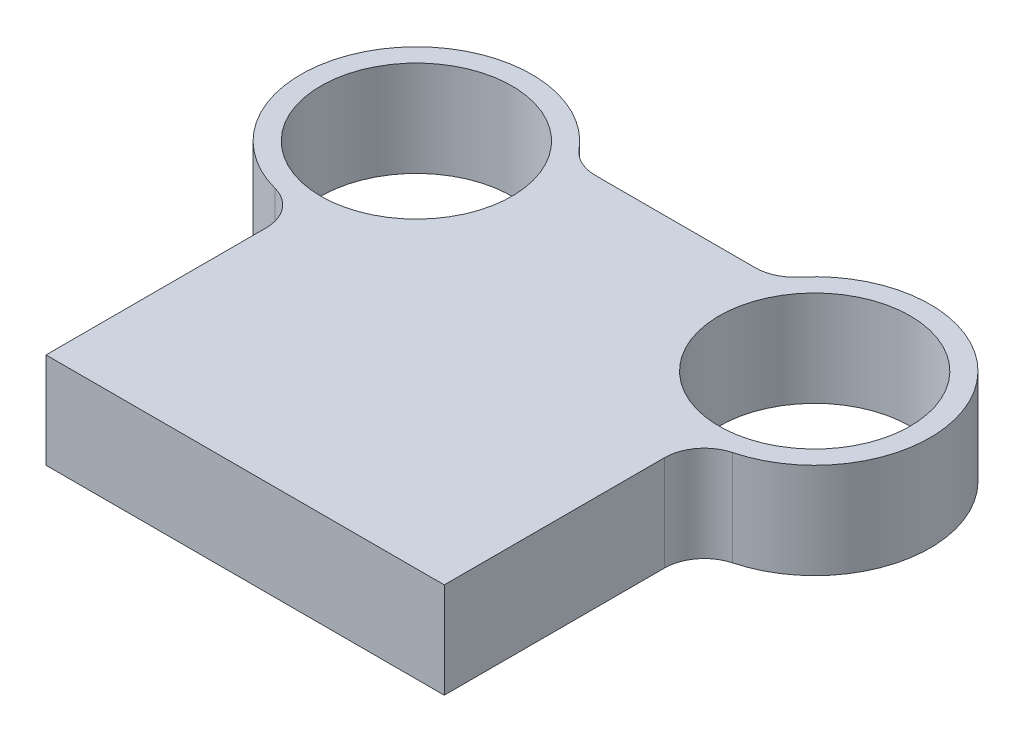
ISO-10303-21;
HEADER;
FILE_DESCRIPTION(('STEP AP214'),'2;1');
FILE_NAME('part.step','',(''),(''),'','','');
FILE_SCHEMA(('AUTOMOTIVE_DESIGN { 1 0 10303 214 1 1 1 1 }'));
ENDSEC;
DATA;
#1=APPLICATION_CONTEXT('core data for automotive mechanical design processes');
#2=APPLICATION_PROTOCOL_DEFINITION('international standard','automotive_design',2000,#1);
#3=PRODUCT_CONTEXT('',#1,'mechanical');
#4=PRODUCT('Part','Part','',(#3));
#5=PRODUCT_RELATED_PRODUCT_CATEGORY('part','',(#4));
#6=PRODUCT_DEFINITION_FORMATION('','',#4);
#7=PRODUCT_DEFINITION_CONTEXT('part definition',#1,'design');
#8=PRODUCT_DEFINITION('design','',#6,#7);
#9=PRODUCT_DEFINITION_SHAPE('','',#8);
#10=(LENGTH_UNIT() NAMED_UNIT(*) SI_UNIT(.MILLI.,.METRE.));
#11=(NAMED_UNIT(*) PLANE_ANGLE_UNIT() SI_UNIT($,.RADIAN.));
#12=(NAMED_UNIT(*) SI_UNIT($,.STERADIAN.) SOLID_ANGLE_UNIT());
#13=UNCERTAINTY_MEASURE_WITH_UNIT(LENGTH_MEASURE(1.E-05),#10,'distance_accuracy_value','');
#14=(GEOMETRIC_REPRESENTATION_CONTEXT(3) GLOBAL_UNCERTAINTY_ASSIGNED_CONTEXT((#13)) GLOBAL_UNIT_ASSIGNED_CONTEXT((#10,
#11,#12)) REPRESENTATION_CONTEXT('',''));
#15=CARTESIAN_POINT('',(0.,0.,0.));
#16=DIRECTION('',(0.,0.,1.));
#17=DIRECTION('',(1.,0.,0.));
#18=AXIS2_PLACEMENT_3D('',#15,#16,#17);
#19=CARTESIAN_POINT('',(-50.,24.,-93.));
#20=DIRECTION('',(0.,1.,0.));
#21=DIRECTION('',(0.,0.,1.));
#22=AXIS2_PLACEMENT_3D('',#19,#20,#21);
#23=PLANE('',#22);
#24=CARTESIAN_POINT('',(-50.,24.,-93.));
#25=DIRECTION('',(0.,1.,0.));
#26=DIRECTION('',(0.,0.,1.));
#27=AXIS2_PLACEMENT_3D('',#24,#25,#26);
#28=CIRCLE('',#27,24.);
#29=CARTESIAN_POINT('',(-50.,24.,-69.));
#30=VERTEX_POINT('',#29);
#31=EDGE_CURVE('E240',#30,#30,#28,.T.);
#32=ORIENTED_EDGE('',*,*,#31,.F.);
#33=EDGE_LOOP('',(#32));
#34=FACE_BOUND('',#33,.T.);
#35=CARTESIAN_POINT('',(-50.,24.,-93.));
#36=DIRECTION('',(0.,1.,0.));
#37=DIRECTION('',(0.,0.,1.));
#38=AXIS2_PLACEMENT_3D('',#35,#36,#37);
#39=CIRCLE('',#38,29.);
#40=CARTESIAN_POINT('',(-27.7419355453448,24.,-111.589743589744));
#41=VERTEX_POINT('',#40);
#42=CARTESIAN_POINT('',(-57.4358974358974,24.,-64.9695267731204));
#43=VERTEX_POINT('',#42);
#44=EDGE_CURVE('E133',#41,#43,#39,.T.);
#45=ORIENTED_EDGE('',*,*,#44,.T.);
#46=CARTESIAN_POINT('',(-60.,24.,-55.3038463500585));
#47=DIRECTION('',(0.,1.,0.));
#48=DIRECTION('',(0.,0.,1.));
#49=AXIS2_PLACEMENT_3D('',#46,#47,#48);
#50=CIRCLE('',#49,10.);
#51=CARTESIAN_POINT('',(-50.,24.,-55.3038463500585));
#52=VERTEX_POINT('',#51);
#53=EDGE_CURVE('E11',#43,#52,#50,.F.);
#54=ORIENTED_EDGE('',*,*,#53,.T.);
#55=DIRECTION('',(0.,0.,1.));
#56=VECTOR('',#55,1.);
#57=CARTESIAN_POINT('',(-50.,24.,0.));
#58=LINE('',#57,#56);
#59=CARTESIAN_POINT('',(-50.,24.,0.));
#60=VERTEX_POINT('',#59);
#61=EDGE_CURVE('E106',#52,#60,#58,.T.);
#62=ORIENTED_EDGE('',*,*,#61,.T.);
#63=DIRECTION('',(1.,0.,0.));
#64=VECTOR('',#63,1.);
#65=CARTESIAN_POINT('',(50.,24.,0.));
#66=LINE('',#65,#64);
#67=CARTESIAN_POINT('',(50.,24.,0.));
#68=VERTEX_POINT('',#67);
#69=EDGE_CURVE('E110',#60,#68,#66,.T.);
#70=ORIENTED_EDGE('',*,*,#69,.T.);
#71=DIRECTION('',(0.,0.,-1.));
#72=VECTOR('',#71,1.);
#73=CARTESIAN_POINT('',(50.,24.,0.));
#74=LINE('',#73,#72);
#75=CARTESIAN_POINT('',(50.,24.,-55.3038463500585));
#76=VERTEX_POINT('',#75);
#77=EDGE_CURVE('E123',#68,#76,#74,.T.);
#78=ORIENTED_EDGE('',*,*,#77,.T.);
#79=CARTESIAN_POINT('',(60.,24.,-55.3038463500585));
#80=DIRECTION('',(0.,1.,0.));
#81=DIRECTION('',(0.,0.,1.));
#82=AXIS2_PLACEMENT_3D('',#79,#80,#81);
#83=CIRCLE('',#82,10.);
#84=CARTESIAN_POINT('',(57.4358974358974,24.,-64.9695267731204));
#85=VERTEX_POINT('',#84);
#86=EDGE_CURVE('E155',#76,#85,#83,.F.);
#87=ORIENTED_EDGE('',*,*,#86,.T.);
#88=CARTESIAN_POINT('',(50.,24.,-93.));
#89=DIRECTION('',(0.,1.,0.));
#90=DIRECTION('',(0.,0.,-1.));
#91=AXIS2_PLACEMENT_3D('',#88,#89,#90);
#92=CIRCLE('',#91,29.);
#93=CARTESIAN_POINT('',(27.7419355453448,24.,-111.589743589744));
#94=VERTEX_POINT('',#93);
#95=EDGE_CURVE('E229',#85,#94,#92,.T.);
#96=ORIENTED_EDGE('',*,*,#95,.T.);
#97=CARTESIAN_POINT('',(20.0667409058085,24.,-118.));
#98=DIRECTION('',(0.,1.,0.));
#99=DIRECTION('',(0.,0.,1.));
#100=AXIS2_PLACEMENT_3D('',#97,#98,#99);
#101=CIRCLE('',#100,10.);
#102=CARTESIAN_POINT('',(20.0667409058085,24.,-108.));
#103=VERTEX_POINT('',#102);
#104=EDGE_CURVE('E159',#94,#103,#101,.F.);
#105=ORIENTED_EDGE('',*,*,#104,.T.);
#106=DIRECTION('',(-1.,0.,0.));
#107=VECTOR('',#106,1.);
#108=CARTESIAN_POINT('',(25.1806527080183,24.,-108.));
#109=LINE('',#108,#107);
#110=CARTESIAN_POINT('',(-20.0667409058085,24.,-108.));
#111=VERTEX_POINT('',#110);
#112=EDGE_CURVE('E226',#103,#111,#109,.T.);
#113=ORIENTED_EDGE('',*,*,#112,.T.);
#114=CARTESIAN_POINT('',(-20.0667409058085,24.,-118.));
#115=DIRECTION('',(0.,1.,0.));
#116=DIRECTION('',(0.,0.,1.));
#117=AXIS2_PLACEMENT_3D('',#114,#115,#116);
#118=CIRCLE('',#117,10.);
#119=EDGE_CURVE('E163',#111,#41,#118,.F.);
#120=ORIENTED_EDGE('',*,*,#119,.T.);
#121=EDGE_LOOP('',(#45,#54,#62,#70,#78,#87,#96,#105,#113,#120));
#122=FACE_BOUND('',#121,.T.);
#123=CARTESIAN_POINT('',(50.,24.,-93.));
#124=DIRECTION('',(0.,1.,0.));
#125=DIRECTION('',(0.,0.,-1.));
#126=AXIS2_PLACEMENT_3D('',#123,#124,#125);
#127=CIRCLE('',#126,24.);
#128=CARTESIAN_POINT('',(50.,24.,-117.));
#129=VERTEX_POINT('',#128);
#130=EDGE_CURVE('E257',#129,#129,#127,.T.);
#131=ORIENTED_EDGE('',*,*,#130,.F.);
#132=EDGE_LOOP('',(#131));
#133=FACE_BOUND('',#132,.T.);
#134=ADVANCED_FACE('F33',(#34,#122,#133),#23,.T.);
#135=CARTESIAN_POINT('',(-50.,0.,-93.));
#136=DIRECTION('',(0.,1.,0.));
#137=DIRECTION('',(0.,0.,1.));
#138=AXIS2_PLACEMENT_3D('',#135,#136,#137);
#139=PLANE('',#138);
#140=DIRECTION('',(0.,0.,1.));
#141=VECTOR('',#140,1.);
#142=CARTESIAN_POINT('',(-50.,0.,0.));
#143=LINE('',#142,#141);
#144=CARTESIAN_POINT('',(-50.,0.,-55.3038463500585));
#145=VERTEX_POINT('',#144);
#146=CARTESIAN_POINT('',(-50.,0.,0.));
#147=VERTEX_POINT('',#146);
#148=EDGE_CURVE('E127',#145,#147,#143,.T.);
#149=ORIENTED_EDGE('',*,*,#148,.F.);
#150=CARTESIAN_POINT('',(-60.,0.,-55.3038463500585));
#151=DIRECTION('',(0.,1.,0.));
#152=DIRECTION('',(0.,0.,1.));
#153=AXIS2_PLACEMENT_3D('',#150,#151,#152);
#154=CIRCLE('',#153,10.);
#155=CARTESIAN_POINT('',(-57.4358974358974,0.,-64.9695267731204));
#156=VERTEX_POINT('',#155);
#157=EDGE_CURVE('E41',#145,#156,#154,.T.);
#158=ORIENTED_EDGE('',*,*,#157,.T.);
#159=CARTESIAN_POINT('',(-50.,0.,-93.));
#160=DIRECTION('',(0.,1.,0.));
#161=DIRECTION('',(0.,0.,1.));
#162=AXIS2_PLACEMENT_3D('',#159,#160,#161);
#163=CIRCLE('',#162,29.);
#164=CARTESIAN_POINT('',(-27.7419355453448,0.,-111.589743589744));
#165=VERTEX_POINT('',#164);
#166=EDGE_CURVE('E114',#165,#156,#163,.T.);
#167=ORIENTED_EDGE('',*,*,#166,.F.);
#168=CARTESIAN_POINT('',(-20.0667409058085,0.,-118.));
#169=DIRECTION('',(0.,1.,0.));
#170=DIRECTION('',(0.,0.,1.));
#171=AXIS2_PLACEMENT_3D('',#168,#169,#170);
#172=CIRCLE('',#171,10.);
#173=CARTESIAN_POINT('',(-20.0667409058085,0.,-108.));
#174=VERTEX_POINT('',#173);
#175=EDGE_CURVE('E161',#165,#174,#172,.T.);
#176=ORIENTED_EDGE('',*,*,#175,.T.);
#177=DIRECTION('',(-1.,0.,0.));
#178=VECTOR('',#177,1.);
#179=CARTESIAN_POINT('',(25.1806527080183,0.,-108.));
#180=LINE('',#179,#178);
#181=CARTESIAN_POINT('',(20.0667409058085,0.,-108.));
#182=VERTEX_POINT('',#181);
#183=EDGE_CURVE('E173',#182,#174,#180,.T.);
#184=ORIENTED_EDGE('',*,*,#183,.F.);
#185=CARTESIAN_POINT('',(20.0667409058085,0.,-118.));
#186=DIRECTION('',(0.,1.,0.));
#187=DIRECTION('',(0.,0.,1.));
#188=AXIS2_PLACEMENT_3D('',#185,#186,#187);
#189=CIRCLE('',#188,10.);
#190=CARTESIAN_POINT('',(27.7419355453448,0.,-111.589743589744));
#191=VERTEX_POINT('',#190);
#192=EDGE_CURVE('E157',#182,#191,#189,.T.);
#193=ORIENTED_EDGE('',*,*,#192,.T.);
#194=CARTESIAN_POINT('',(50.,0.,-93.));
#195=DIRECTION('',(0.,1.,0.));
#196=DIRECTION('',(0.,0.,-1.));
#197=AXIS2_PLACEMENT_3D('',#194,#195,#196);
#198=CIRCLE('',#197,29.);
#199=CARTESIAN_POINT('',(57.4358974358974,0.,-64.9695267731204));
#200=VERTEX_POINT('',#199);
#201=EDGE_CURVE('E245',#200,#191,#198,.T.);
#202=ORIENTED_EDGE('',*,*,#201,.F.);
#203=CARTESIAN_POINT('',(60.,0.,-55.3038463500585));
#204=DIRECTION('',(0.,1.,0.));
#205=DIRECTION('',(0.,0.,1.));
#206=AXIS2_PLACEMENT_3D('',#203,#204,#205);
#207=CIRCLE('',#206,10.);
#208=CARTESIAN_POINT('',(50.,0.,-55.3038463500585));
#209=VERTEX_POINT('',#208);
#210=EDGE_CURVE('E153',#200,#209,#207,.T.);
#211=ORIENTED_EDGE('',*,*,#210,.T.);
#212=DIRECTION('',(0.,0.,-1.));
#213=VECTOR('',#212,1.);
#214=CARTESIAN_POINT('',(50.,0.,0.));
#215=LINE('',#214,#213);
#216=CARTESIAN_POINT('',(50.,0.,0.));
#217=VERTEX_POINT('',#216);
#218=EDGE_CURVE('E242',#217,#209,#215,.T.);
#219=ORIENTED_EDGE('',*,*,#218,.F.);
#220=DIRECTION('',(1.,0.,0.));
#221=VECTOR('',#220,1.);
#222=CARTESIAN_POINT('',(50.,0.,0.));
#223=LINE('',#222,#221);
#224=EDGE_CURVE('E239',#147,#217,#223,.T.);
#225=ORIENTED_EDGE('',*,*,#224,.F.);
#226=EDGE_LOOP('',(#149,#158,#167,#176,#184,#193,#202,#211,#219,#225));
#227=FACE_BOUND('',#226,.T.);
#228=CARTESIAN_POINT('',(-50.,0.,-93.));
#229=DIRECTION('',(0.,1.,0.));
#230=DIRECTION('',(0.,0.,1.));
#231=AXIS2_PLACEMENT_3D('',#228,#229,#230);
#232=CIRCLE('',#231,24.);
#233=CARTESIAN_POINT('',(-50.,0.,-69.));
#234=VERTEX_POINT('',#233);
#235=EDGE_CURVE('E254',#234,#234,#232,.T.);
#236=ORIENTED_EDGE('',*,*,#235,.T.);
#237=EDGE_LOOP('',(#236));
#238=FACE_BOUND('',#237,.T.);
#239=CARTESIAN_POINT('',(50.,0.,-93.));
#240=DIRECTION('',(0.,1.,0.));
#241=DIRECTION('',(0.,0.,-1.));
#242=AXIS2_PLACEMENT_3D('',#239,#240,#241);
#243=CIRCLE('',#242,24.);
#244=CARTESIAN_POINT('',(50.,0.,-117.));
#245=VERTEX_POINT('',#244);
#246=EDGE_CURVE('E260',#245,#245,#243,.T.);
#247=ORIENTED_EDGE('',*,*,#246,.T.);
#248=EDGE_LOOP('',(#247));
#249=FACE_BOUND('',#248,.T.);
#250=ADVANCED_FACE('F167',(#227,#238,#249),#139,.F.);
#251=CARTESIAN_POINT('',(-50.,24.,0.));
#252=DIRECTION('',(1.,0.,0.));
#253=DIRECTION('',(0.,0.,-1.));
#254=AXIS2_PLACEMENT_3D('',#251,#252,#253);
#255=PLANE('',#254);
#256=ORIENTED_EDGE('',*,*,#61,.F.);
#257=DIRECTION('',(0.,1.,0.));
#258=VECTOR('',#257,1.);
#259=CARTESIAN_POINT('',(-50.,0.,-55.3038463500585));
#260=LINE('',#259,#258);
#261=EDGE_CURVE('E151',#52,#145,#260,.F.);
#262=ORIENTED_EDGE('',*,*,#261,.T.);
#263=ORIENTED_EDGE('',*,*,#148,.T.);
#264=DIRECTION('',(0.,-1.,0.));
#265=VECTOR('',#264,1.);
#266=CARTESIAN_POINT('',(-50.,24.,0.));
#267=LINE('',#266,#265);
#268=EDGE_CURVE('E119',#60,#147,#267,.T.);
#269=ORIENTED_EDGE('',*,*,#268,.F.);
#270=EDGE_LOOP('',(#256,#262,#263,#269));
#271=FACE_BOUND('',#270,.T.);
#272=ADVANCED_FACE('F125',(#271),#255,.F.);
#273=CARTESIAN_POINT('',(50.,24.,0.));
#274=DIRECTION('',(0.,0.,-1.));
#275=DIRECTION('',(-1.,0.,0.));
#276=AXIS2_PLACEMENT_3D('',#273,#274,#275);
#277=PLANE('',#276);
#278=ORIENTED_EDGE('',*,*,#224,.T.);
#279=DIRECTION('',(0.,-1.,0.));
#280=VECTOR('',#279,1.);
#281=CARTESIAN_POINT('',(50.,24.,0.));
#282=LINE('',#281,#280);
#283=EDGE_CURVE('E121',#68,#217,#282,.T.);
#284=ORIENTED_EDGE('',*,*,#283,.F.);
#285=ORIENTED_EDGE('',*,*,#69,.F.);
#286=ORIENTED_EDGE('',*,*,#268,.T.);
#287=EDGE_LOOP('',(#278,#284,#285,#286));
#288=FACE_BOUND('',#287,.T.);
#289=ADVANCED_FACE('F118',(#288),#277,.F.);
#290=CARTESIAN_POINT('',(50.,24.,0.));
#291=DIRECTION('',(-1.,0.,0.));
#292=DIRECTION('',(0.,0.,1.));
#293=AXIS2_PLACEMENT_3D('',#290,#291,#292);
#294=PLANE('',#293);
#295=ORIENTED_EDGE('',*,*,#218,.T.);
#296=DIRECTION('',(0.,1.,0.));
#297=VECTOR('',#296,1.);
#298=CARTESIAN_POINT('',(50.,24.,-55.3038463500585));
#299=LINE('',#298,#297);
#300=EDGE_CURVE('E139',#209,#76,#299,.T.);
#301=ORIENTED_EDGE('',*,*,#300,.T.);
#302=ORIENTED_EDGE('',*,*,#77,.F.);
#303=ORIENTED_EDGE('',*,*,#283,.T.);
#304=EDGE_LOOP('',(#295,#301,#302,#303));
#305=FACE_BOUND('',#304,.T.);
#306=ADVANCED_FACE('F202',(#305),#294,.F.);
#307=CARTESIAN_POINT('',(50.,24.,-93.));
#308=DIRECTION('',(0.,-1.,0.));
#309=DIRECTION('',(0.,0.,-1.));
#310=AXIS2_PLACEMENT_3D('',#307,#308,#309);
#311=CYLINDRICAL_SURFACE('',#310,29.);
#312=ORIENTED_EDGE('',*,*,#95,.F.);
#313=DIRECTION('',(0.,-1.,0.));
#314=VECTOR('',#313,1.);
#315=CARTESIAN_POINT('',(57.4358974358974,24.,-64.9695267731204));
#316=LINE('',#315,#314);
#317=EDGE_CURVE('E131',#85,#200,#316,.T.);
#318=ORIENTED_EDGE('',*,*,#317,.T.);
#319=ORIENTED_EDGE('',*,*,#201,.T.);
#320=DIRECTION('',(0.,-1.,0.));
#321=VECTOR('',#320,1.);
#322=CARTESIAN_POINT('',(27.7419355453448,24.,-111.589743589744));
#323=LINE('',#322,#321);
#324=EDGE_CURVE('E129',#191,#94,#323,.F.);
#325=ORIENTED_EDGE('',*,*,#324,.T.);
#326=EDGE_LOOP('',(#312,#318,#319,#325));
#327=FACE_BOUND('',#326,.T.);
#328=ADVANCED_FACE('F198',(#327),#311,.T.);
#329=CARTESIAN_POINT('',(25.1806527080183,24.,-108.));
#330=DIRECTION('',(0.,0.,1.));
#331=DIRECTION('',(1.,0.,0.));
#332=AXIS2_PLACEMENT_3D('',#329,#330,#331);
#333=PLANE('',#332);
#334=ORIENTED_EDGE('',*,*,#112,.F.);
#335=DIRECTION('',(0.,1.,0.));
#336=VECTOR('',#335,1.);
#337=CARTESIAN_POINT('',(20.0667409058085,0.,-108.));
#338=LINE('',#337,#336);
#339=EDGE_CURVE('E143',#103,#182,#338,.F.);
#340=ORIENTED_EDGE('',*,*,#339,.T.);
#341=ORIENTED_EDGE('',*,*,#183,.T.);
#342=DIRECTION('',(0.,1.,0.));
#343=VECTOR('',#342,1.);
#344=CARTESIAN_POINT('',(-20.0667409058085,24.,-108.));
#345=LINE('',#344,#343);
#346=EDGE_CURVE('E141',#174,#111,#345,.T.);
#347=ORIENTED_EDGE('',*,*,#346,.T.);
#348=EDGE_LOOP('',(#334,#340,#341,#347));
#349=FACE_BOUND('',#348,.T.);
#350=ADVANCED_FACE('F195',(#349),#333,.F.);
#351=CARTESIAN_POINT('',(-50.,24.,-93.));
#352=DIRECTION('',(0.,-1.,0.));
#353=DIRECTION('',(0.,0.,-1.));
#354=AXIS2_PLACEMENT_3D('',#351,#352,#353);
#355=CYLINDRICAL_SURFACE('',#354,29.);
#356=ORIENTED_EDGE('',*,*,#44,.F.);
#357=DIRECTION('',(0.,-1.,0.));
#358=VECTOR('',#357,1.);
#359=CARTESIAN_POINT('',(-27.7419355453448,24.,-111.589743589744));
#360=LINE('',#359,#358);
#361=EDGE_CURVE('E148',#41,#165,#360,.T.);
#362=ORIENTED_EDGE('',*,*,#361,.T.);
#363=ORIENTED_EDGE('',*,*,#166,.T.);
#364=DIRECTION('',(0.,-1.,0.));
#365=VECTOR('',#364,1.);
#366=CARTESIAN_POINT('',(-57.4358974358974,24.,-64.9695267731204));
#367=LINE('',#366,#365);
#368=EDGE_CURVE('E146',#156,#43,#367,.F.);
#369=ORIENTED_EDGE('',*,*,#368,.T.);
#370=EDGE_LOOP('',(#356,#362,#363,#369));
#371=FACE_BOUND('',#370,.T.);
#372=ADVANCED_FACE('F171',(#371),#355,.T.);
#373=CARTESIAN_POINT('',(-50.,24.,-93.));
#374=DIRECTION('',(0.,-1.,0.));
#375=DIRECTION('',(0.,0.,-1.));
#376=AXIS2_PLACEMENT_3D('',#373,#374,#375);
#377=CYLINDRICAL_SURFACE('',#376,24.);
#378=ORIENTED_EDGE('',*,*,#31,.T.);
#379=EDGE_LOOP('',(#378));
#380=FACE_BOUND('',#379,.T.);
#381=ORIENTED_EDGE('',*,*,#235,.F.);
#382=EDGE_LOOP('',(#381));
#383=FACE_BOUND('',#382,.T.);
#384=ADVANCED_FACE('F190',(#380,#383),#377,.F.);
#385=CARTESIAN_POINT('',(50.,24.,-93.));
#386=DIRECTION('',(0.,-1.,0.));
#387=DIRECTION('',(0.,0.,-1.));
#388=AXIS2_PLACEMENT_3D('',#385,#386,#387);
#389=CYLINDRICAL_SURFACE('',#388,24.);
#390=ORIENTED_EDGE('',*,*,#130,.T.);
#391=EDGE_LOOP('',(#390));
#392=FACE_BOUND('',#391,.T.);
#393=ORIENTED_EDGE('',*,*,#246,.F.);
#394=EDGE_LOOP('',(#393));
#395=FACE_BOUND('',#394,.T.);
#396=ADVANCED_FACE('F214',(#392,#395),#389,.F.);
#397=CARTESIAN_POINT('',(60.,24.,-55.3038463500585));
#398=DIRECTION('',(0.,-1.,0.));
#399=DIRECTION('',(0.,0.,-1.));
#400=AXIS2_PLACEMENT_3D('',#397,#398,#399);
#401=CYLINDRICAL_SURFACE('',#400,10.);
#402=ORIENTED_EDGE('',*,*,#86,.F.);
#403=ORIENTED_EDGE('',*,*,#300,.F.);
#404=ORIENTED_EDGE('',*,*,#210,.F.);
#405=ORIENTED_EDGE('',*,*,#317,.F.);
#406=EDGE_LOOP('',(#402,#403,#404,#405));
#407=FACE_BOUND('',#406,.T.);
#408=ADVANCED_FACE('F211',(#407),#401,.F.);
#409=CARTESIAN_POINT('',(20.0667409058085,24.,-118.));
#410=DIRECTION('',(0.,-1.,0.));
#411=DIRECTION('',(0.,0.,-1.));
#412=AXIS2_PLACEMENT_3D('',#409,#410,#411);
#413=CYLINDRICAL_SURFACE('',#412,10.);
#414=ORIENTED_EDGE('',*,*,#104,.F.);
#415=ORIENTED_EDGE('',*,*,#324,.F.);
#416=ORIENTED_EDGE('',*,*,#192,.F.);
#417=ORIENTED_EDGE('',*,*,#339,.F.);
#418=EDGE_LOOP('',(#414,#415,#416,#417));
#419=FACE_BOUND('',#418,.T.);
#420=ADVANCED_FACE('F179',(#419),#413,.F.);
#421=CARTESIAN_POINT('',(-20.0667409058085,24.,-118.));
#422=DIRECTION('',(0.,-1.,0.));
#423=DIRECTION('',(0.,0.,-1.));
#424=AXIS2_PLACEMENT_3D('',#421,#422,#423);
#425=CYLINDRICAL_SURFACE('',#424,10.);
#426=ORIENTED_EDGE('',*,*,#119,.F.);
#427=ORIENTED_EDGE('',*,*,#346,.F.);
#428=ORIENTED_EDGE('',*,*,#175,.F.);
#429=ORIENTED_EDGE('',*,*,#361,.F.);
#430=EDGE_LOOP('',(#426,#427,#428,#429));
#431=FACE_BOUND('',#430,.T.);
#432=ADVANCED_FACE('F175',(#431),#425,.F.);
#433=CARTESIAN_POINT('',(-60.,24.,-55.3038463500585));
#434=DIRECTION('',(0.,-1.,0.));
#435=DIRECTION('',(0.,0.,-1.));
#436=AXIS2_PLACEMENT_3D('',#433,#434,#435);
#437=CYLINDRICAL_SURFACE('',#436,10.);
#438=ORIENTED_EDGE('',*,*,#53,.F.);
#439=ORIENTED_EDGE('',*,*,#368,.F.);
#440=ORIENTED_EDGE('',*,*,#157,.F.);
#441=ORIENTED_EDGE('',*,*,#261,.F.);
#442=EDGE_LOOP('',(#438,#439,#440,#441));
#443=FACE_BOUND('',#442,.T.);
#444=ADVANCED_FACE('F35',(#443),#437,.F.);
#445=CLOSED_SHELL('',(#134,#250,#272,#289,#306,#328,#350,#372,#384,#396,#408,#420,#432,#444));
#446=MANIFOLD_SOLID_BREP('B2',#445);
#447=ADVANCED_BREP_SHAPE_REPRESENTATION('',(#18,#446),#14);
#448=SHAPE_DEFINITION_REPRESENTATION(#9,#447);
ENDSEC;
END-ISO-10303-21;
